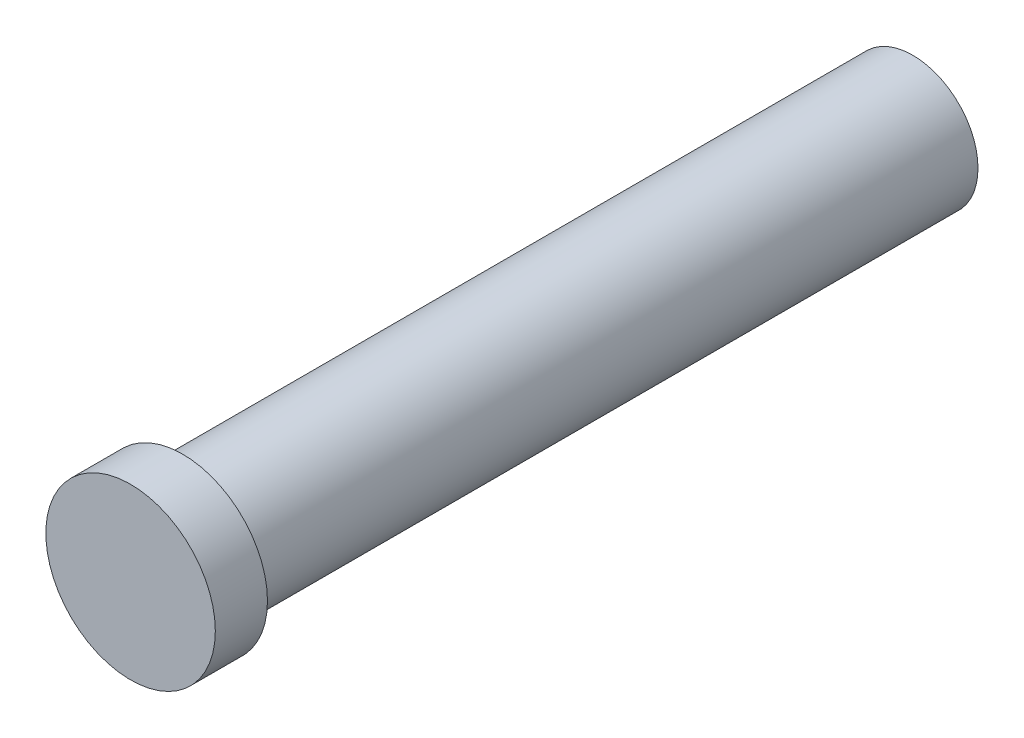
ISO-10303-21;
HEADER;
FILE_DESCRIPTION(('STEP AP214'),'2;1');
FILE_NAME('part.step','',(''),(''),'','','');
FILE_SCHEMA(('AUTOMOTIVE_DESIGN { 1 0 10303 214 1 1 1 1 }'));
ENDSEC;
DATA;
#1=APPLICATION_CONTEXT('core data for automotive mechanical design processes');
#2=APPLICATION_PROTOCOL_DEFINITION('international standard','automotive_design',2000,#1);
#3=PRODUCT_CONTEXT('',#1,'mechanical');
#4=PRODUCT('Part','Part','',(#3));
#5=PRODUCT_RELATED_PRODUCT_CATEGORY('part','',(#4));
#6=PRODUCT_DEFINITION_FORMATION('','',#4);
#7=PRODUCT_DEFINITION_CONTEXT('part definition',#1,'design');
#8=PRODUCT_DEFINITION('design','',#6,#7);
#9=PRODUCT_DEFINITION_SHAPE('','',#8);
#10=(LENGTH_UNIT() NAMED_UNIT(*) SI_UNIT(.MILLI.,.METRE.));
#11=(NAMED_UNIT(*) PLANE_ANGLE_UNIT() SI_UNIT($,.RADIAN.));
#12=(NAMED_UNIT(*) SI_UNIT($,.STERADIAN.) SOLID_ANGLE_UNIT());
#13=UNCERTAINTY_MEASURE_WITH_UNIT(LENGTH_MEASURE(1.E-05),#10,'distance_accuracy_value','');
#14=(GEOMETRIC_REPRESENTATION_CONTEXT(3) GLOBAL_UNCERTAINTY_ASSIGNED_CONTEXT((#13)) GLOBAL_UNIT_ASSIGNED_CONTEXT((#10,
#11,#12)) REPRESENTATION_CONTEXT('',''));
#15=CARTESIAN_POINT('',(0.,0.,0.));
#16=DIRECTION('',(0.,0.,1.));
#17=DIRECTION('',(1.,0.,0.));
#18=AXIS2_PLACEMENT_3D('',#15,#16,#17);
#19=CARTESIAN_POINT('',(0.,0.,56.));
#20=DIRECTION('',(0.,0.,-1.));
#21=DIRECTION('',(-1.,0.,0.));
#22=AXIS2_PLACEMENT_3D('',#19,#20,#21);
#23=CYLINDRICAL_SURFACE('',#22,5.);
#24=CARTESIAN_POINT('',(0.,0.,56.));
#25=DIRECTION('',(0.,0.,1.));
#26=DIRECTION('',(1.,0.,0.));
#27=AXIS2_PLACEMENT_3D('',#24,#25,#26);
#28=CIRCLE('',#27,5.);
#29=CARTESIAN_POINT('',(5.,0.,56.));
#30=VERTEX_POINT('',#29);
#31=EDGE_CURVE('E11',#30,#30,#28,.T.);
#32=ORIENTED_EDGE('',*,*,#31,.F.);
#33=EDGE_LOOP('',(#32));
#34=FACE_BOUND('',#33,.T.);
#35=CARTESIAN_POINT('',(0.,0.,0.));
#36=DIRECTION('',(0.,0.,1.));
#37=DIRECTION('',(1.,0.,0.));
#38=AXIS2_PLACEMENT_3D('',#35,#36,#37);
#39=CIRCLE('',#38,5.);
#40=CARTESIAN_POINT('',(5.,0.,0.));
#41=VERTEX_POINT('',#40);
#42=EDGE_CURVE('E40',#41,#41,#39,.T.);
#43=ORIENTED_EDGE('',*,*,#42,.T.);
#44=EDGE_LOOP('',(#43));
#45=FACE_BOUND('',#44,.T.);
#46=ADVANCED_FACE('F37',(#34,#45),#23,.T.);
#47=CARTESIAN_POINT('',(0.,0.,0.));
#48=DIRECTION('',(0.,0.,1.));
#49=DIRECTION('',(1.,0.,0.));
#50=AXIS2_PLACEMENT_3D('',#47,#48,#49);
#51=PLANE('',#50);
#52=CARTESIAN_POINT('',(0.,0.,0.));
#53=DIRECTION('',(0.,0.,-1.));
#54=DIRECTION('',(-1.,0.,0.));
#55=AXIS2_PLACEMENT_3D('',#52,#53,#54);
#56=CIRCLE('',#55,2.5);
#57=CARTESIAN_POINT('',(-2.5,0.,0.));
#58=VERTEX_POINT('',#57);
#59=EDGE_CURVE('E57',#58,#58,#56,.T.);
#60=ORIENTED_EDGE('',*,*,#59,.F.);
#61=EDGE_LOOP('',(#60));
#62=FACE_BOUND('',#61,.T.);
#63=ORIENTED_EDGE('',*,*,#42,.F.);
#64=EDGE_LOOP('',(#63));
#65=FACE_BOUND('',#64,.T.);
#66=ADVANCED_FACE('F72',(#62,#65),#51,.F.);
#67=CARTESIAN_POINT('',(0.,0.,60.));
#68=DIRECTION('',(0.,0.,-1.));
#69=DIRECTION('',(-1.,0.,0.));
#70=AXIS2_PLACEMENT_3D('',#67,#68,#69);
#71=CYLINDRICAL_SURFACE('',#70,6.5);
#72=CARTESIAN_POINT('',(0.,0.,60.));
#73=DIRECTION('',(0.,0.,1.));
#74=DIRECTION('',(1.,0.,0.));
#75=AXIS2_PLACEMENT_3D('',#72,#73,#74);
#76=CIRCLE('',#75,6.5);
#77=CARTESIAN_POINT('',(6.5,0.,60.));
#78=VERTEX_POINT('',#77);
#79=EDGE_CURVE('E60',#78,#78,#76,.T.);
#80=ORIENTED_EDGE('',*,*,#79,.F.);
#81=EDGE_LOOP('',(#80));
#82=FACE_BOUND('',#81,.T.);
#83=CARTESIAN_POINT('',(0.,0.,56.));
#84=DIRECTION('',(0.,0.,1.));
#85=DIRECTION('',(1.,0.,0.));
#86=AXIS2_PLACEMENT_3D('',#83,#84,#85);
#87=CIRCLE('',#86,6.5);
#88=CARTESIAN_POINT('',(6.5,0.,56.));
#89=VERTEX_POINT('',#88);
#90=EDGE_CURVE('E56',#89,#89,#87,.T.);
#91=ORIENTED_EDGE('',*,*,#90,.T.);
#92=EDGE_LOOP('',(#91));
#93=FACE_BOUND('',#92,.T.);
#94=ADVANCED_FACE('F74',(#82,#93),#71,.T.);
#95=CARTESIAN_POINT('',(0.,0.,60.));
#96=DIRECTION('',(0.,0.,1.));
#97=DIRECTION('',(1.,0.,0.));
#98=AXIS2_PLACEMENT_3D('',#95,#96,#97);
#99=PLANE('',#98);
#100=ORIENTED_EDGE('',*,*,#79,.T.);
#101=EDGE_LOOP('',(#100));
#102=FACE_BOUND('',#101,.T.);
#103=ADVANCED_FACE('F80',(#102),#99,.T.);
#104=CARTESIAN_POINT('',(0.,0.,56.));
#105=DIRECTION('',(0.,0.,1.));
#106=DIRECTION('',(1.,0.,0.));
#107=AXIS2_PLACEMENT_3D('',#104,#105,#106);
#108=PLANE('',#107);
#109=ORIENTED_EDGE('',*,*,#31,.T.);
#110=EDGE_LOOP('',(#109));
#111=FACE_BOUND('',#110,.T.);
#112=ORIENTED_EDGE('',*,*,#90,.F.);
#113=EDGE_LOOP('',(#112));
#114=FACE_BOUND('',#113,.T.);
#115=ADVANCED_FACE('F50',(#111,#114),#108,.F.);
#116=CARTESIAN_POINT('',(0.,0.,15.));
#117=DIRECTION('',(0.,0.,-1.));
#118=DIRECTION('',(-1.,0.,0.));
#119=AXIS2_PLACEMENT_3D('',#116,#117,#118);
#120=CONICAL_SURFACE('',#119,2.5,1.02974425867665);
#121=CARTESIAN_POINT('',(0.,0.,16.5021515475689));
#122=VERTEX_POINT('',#121);
#123=VERTEX_LOOP('',#122);
#124=FACE_BOUND('',#123,.T.);
#125=CARTESIAN_POINT('',(0.,0.,15.));
#126=DIRECTION('',(0.,0.,-1.));
#127=DIRECTION('',(-1.,0.,0.));
#128=AXIS2_PLACEMENT_3D('',#125,#126,#127);
#129=CIRCLE('',#128,2.5);
#130=CARTESIAN_POINT('',(-2.5,0.,15.));
#131=VERTEX_POINT('',#130);
#132=EDGE_CURVE('E54',#131,#131,#129,.T.);
#133=ORIENTED_EDGE('',*,*,#132,.T.);
#134=EDGE_LOOP('',(#133));
#135=FACE_BOUND('',#134,.T.);
#136=ADVANCED_FACE('F46',(#124,#135),#120,.F.);
#137=CARTESIAN_POINT('',(0.,0.,0.));
#138=DIRECTION('',(0.,0.,-1.));
#139=DIRECTION('',(-1.,0.,0.));
#140=AXIS2_PLACEMENT_3D('',#137,#138,#139);
#141=CYLINDRICAL_SURFACE('',#140,2.5);
#142=ORIENTED_EDGE('',*,*,#132,.F.);
#143=EDGE_LOOP('',(#142));
#144=FACE_BOUND('',#143,.T.);
#145=ORIENTED_EDGE('',*,*,#59,.T.);
#146=EDGE_LOOP('',(#145));
#147=FACE_BOUND('',#146,.T.);
#148=ADVANCED_FACE('F49',(#144,#147),#141,.F.);
#149=CLOSED_SHELL('',(#46,#66,#94,#103,#115,#136,#148));
#150=MANIFOLD_SOLID_BREP('B2',#149);
#151=ADVANCED_BREP_SHAPE_REPRESENTATION('',(#18,#150),#14);
#152=SHAPE_DEFINITION_REPRESENTATION(#9,#151);
ENDSEC;
END-ISO-10303-21;
